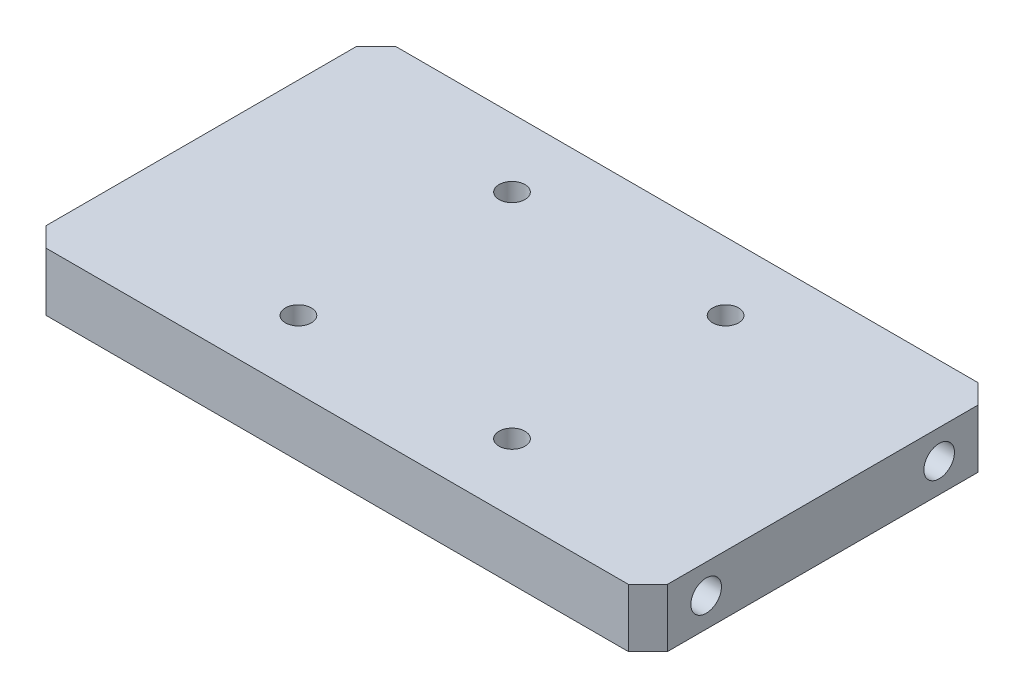
ISO-10303-21;
HEADER;
FILE_DESCRIPTION(('STEP AP214'),'2;1');
FILE_NAME('part.step','',(''),(''),'','','');
FILE_SCHEMA(('AUTOMOTIVE_DESIGN { 1 0 10303 214 1 1 1 1 }'));
ENDSEC;
DATA;
#1=APPLICATION_CONTEXT('core data for automotive mechanical design processes');
#2=APPLICATION_PROTOCOL_DEFINITION('international standard','automotive_design',2000,#1);
#3=PRODUCT_CONTEXT('',#1,'mechanical');
#4=PRODUCT('Part','Part','',(#3));
#5=PRODUCT_RELATED_PRODUCT_CATEGORY('part','',(#4));
#6=PRODUCT_DEFINITION_FORMATION('','',#4);
#7=PRODUCT_DEFINITION_CONTEXT('part definition',#1,'design');
#8=PRODUCT_DEFINITION('design','',#6,#7);
#9=PRODUCT_DEFINITION_SHAPE('','',#8);
#10=(LENGTH_UNIT() NAMED_UNIT(*) SI_UNIT(.MILLI.,.METRE.));
#11=(NAMED_UNIT(*) PLANE_ANGLE_UNIT() SI_UNIT($,.RADIAN.));
#12=(NAMED_UNIT(*) SI_UNIT($,.STERADIAN.) SOLID_ANGLE_UNIT());
#13=UNCERTAINTY_MEASURE_WITH_UNIT(LENGTH_MEASURE(1.E-05),#10,'distance_accuracy_value','');
#14=(GEOMETRIC_REPRESENTATION_CONTEXT(3) GLOBAL_UNCERTAINTY_ASSIGNED_CONTEXT((#13)) GLOBAL_UNIT_ASSIGNED_CONTEXT((#10,
#11,#12)) REPRESENTATION_CONTEXT('',''));
#15=CARTESIAN_POINT('',(0.,0.,0.));
#16=DIRECTION('',(0.,0.,1.));
#17=DIRECTION('',(1.,0.,0.));
#18=AXIS2_PLACEMENT_3D('',#15,#16,#17);
#19=CARTESIAN_POINT('',(101.6,19.05,57.15));
#20=DIRECTION('',(-1.,0.,0.));
#21=DIRECTION('',(0.,0.,1.));
#22=AXIS2_PLACEMENT_3D('',#19,#20,#21);
#23=PLANE('',#22);
#24=CARTESIAN_POINT('',(101.6,9.525,38.1));
#25=DIRECTION('',(-1.,0.,0.));
#26=DIRECTION('',(0.,0.,-1.));
#27=AXIS2_PLACEMENT_3D('',#24,#25,#26);
#28=CIRCLE('',#27,5.);
#29=CARTESIAN_POINT('',(101.6,9.525,33.1));
#30=VERTEX_POINT('',#29);
#31=EDGE_CURVE('E207',#30,#30,#28,.T.);
#32=ORIENTED_EDGE('',*,*,#31,.T.);
#33=EDGE_LOOP('',(#32));
#34=FACE_BOUND('',#33,.T.);
#35=CARTESIAN_POINT('',(101.6,9.525,-38.1));
#36=DIRECTION('',(-1.,0.,0.));
#37=DIRECTION('',(0.,0.,1.));
#38=AXIS2_PLACEMENT_3D('',#35,#36,#37);
#39=CIRCLE('',#38,5.);
#40=CARTESIAN_POINT('',(101.6,9.525,-33.1));
#41=VERTEX_POINT('',#40);
#42=EDGE_CURVE('E201',#41,#41,#39,.T.);
#43=ORIENTED_EDGE('',*,*,#42,.T.);
#44=EDGE_LOOP('',(#43));
#45=FACE_BOUND('',#44,.T.);
#46=DIRECTION('',(0.,0.,-1.));
#47=VECTOR('',#46,1.);
#48=CARTESIAN_POINT('',(101.6,0.,57.15));
#49=LINE('',#48,#47);
#50=CARTESIAN_POINT('',(101.6,0.,50.8));
#51=VERTEX_POINT('',#50);
#52=CARTESIAN_POINT('',(101.6,0.,-50.7999999999999));
#53=VERTEX_POINT('',#52);
#54=EDGE_CURVE('E137',#51,#53,#49,.T.);
#55=ORIENTED_EDGE('',*,*,#54,.T.);
#56=DIRECTION('',(0.,1.,0.));
#57=VECTOR('',#56,1.);
#58=CARTESIAN_POINT('',(101.6,19.05,-50.7999999999999));
#59=LINE('',#58,#57);
#60=CARTESIAN_POINT('',(101.6,19.05,-50.7999999999999));
#61=VERTEX_POINT('',#60);
#62=EDGE_CURVE('E114',#53,#61,#59,.T.);
#63=ORIENTED_EDGE('',*,*,#62,.T.);
#64=DIRECTION('',(0.,0.,-1.));
#65=VECTOR('',#64,1.);
#66=CARTESIAN_POINT('',(101.6,19.05,57.15));
#67=LINE('',#66,#65);
#68=CARTESIAN_POINT('',(101.6,19.05,50.8));
#69=VERTEX_POINT('',#68);
#70=EDGE_CURVE('E147',#69,#61,#67,.T.);
#71=ORIENTED_EDGE('',*,*,#70,.F.);
#72=DIRECTION('',(0.,-1.,0.));
#73=VECTOR('',#72,1.);
#74=CARTESIAN_POINT('',(101.6,19.05,50.8));
#75=LINE('',#74,#73);
#76=EDGE_CURVE('E119',#69,#51,#75,.T.);
#77=ORIENTED_EDGE('',*,*,#76,.T.);
#78=EDGE_LOOP('',(#55,#63,#71,#77));
#79=FACE_BOUND('',#78,.T.);
#80=ADVANCED_FACE('F42',(#34,#45,#79),#23,.F.);
#81=CARTESIAN_POINT('',(-101.6,19.05,-57.15));
#82=DIRECTION('',(0.,0.,1.));
#83=DIRECTION('',(1.,0.,0.));
#84=AXIS2_PLACEMENT_3D('',#81,#82,#83);
#85=PLANE('',#84);
#86=DIRECTION('',(-1.,0.,0.));
#87=VECTOR('',#86,1.);
#88=CARTESIAN_POINT('',(-101.6,19.05,-57.15));
#89=LINE('',#88,#87);
#90=CARTESIAN_POINT('',(95.25,19.05,-57.15));
#91=VERTEX_POINT('',#90);
#92=CARTESIAN_POINT('',(-95.25,19.05,-57.15));
#93=VERTEX_POINT('',#92);
#94=EDGE_CURVE('E129',#91,#93,#89,.T.);
#95=ORIENTED_EDGE('',*,*,#94,.F.);
#96=DIRECTION('',(0.,-1.,0.));
#97=VECTOR('',#96,1.);
#98=CARTESIAN_POINT('',(95.25,19.05,-57.15));
#99=LINE('',#98,#97);
#100=CARTESIAN_POINT('',(95.25,0.,-57.15));
#101=VERTEX_POINT('',#100);
#102=EDGE_CURVE('E113',#91,#101,#99,.T.);
#103=ORIENTED_EDGE('',*,*,#102,.T.);
#104=DIRECTION('',(-1.,0.,0.));
#105=VECTOR('',#104,1.);
#106=CARTESIAN_POINT('',(-101.6,0.,-57.15));
#107=LINE('',#106,#105);
#108=CARTESIAN_POINT('',(-95.25,0.,-57.15));
#109=VERTEX_POINT('',#108);
#110=EDGE_CURVE('E126',#101,#109,#107,.T.);
#111=ORIENTED_EDGE('',*,*,#110,.T.);
#112=DIRECTION('',(0.,1.,0.));
#113=VECTOR('',#112,1.);
#114=CARTESIAN_POINT('',(-95.25,19.05,-57.15));
#115=LINE('',#114,#113);
#116=EDGE_CURVE('E131',#109,#93,#115,.T.);
#117=ORIENTED_EDGE('',*,*,#116,.T.);
#118=EDGE_LOOP('',(#95,#103,#111,#117));
#119=FACE_BOUND('',#118,.T.);
#120=ADVANCED_FACE('F125',(#119),#85,.F.);
#121=CARTESIAN_POINT('',(-101.6,19.05,57.15));
#122=DIRECTION('',(1.,0.,0.));
#123=DIRECTION('',(0.,0.,-1.));
#124=AXIS2_PLACEMENT_3D('',#121,#122,#123);
#125=PLANE('',#124);
#126=CARTESIAN_POINT('',(-101.6,9.525,38.1));
#127=DIRECTION('',(-1.,0.,0.));
#128=DIRECTION('',(0.,0.,-1.));
#129=AXIS2_PLACEMENT_3D('',#126,#127,#128);
#130=CIRCLE('',#129,5.);
#131=CARTESIAN_POINT('',(-101.6,9.525,33.1));
#132=VERTEX_POINT('',#131);
#133=EDGE_CURVE('E195',#132,#132,#130,.T.);
#134=ORIENTED_EDGE('',*,*,#133,.F.);
#135=EDGE_LOOP('',(#134));
#136=FACE_BOUND('',#135,.T.);
#137=CARTESIAN_POINT('',(-101.6,9.525,-38.1));
#138=DIRECTION('',(-1.,0.,0.));
#139=DIRECTION('',(0.,0.,1.));
#140=AXIS2_PLACEMENT_3D('',#137,#138,#139);
#141=CIRCLE('',#140,5.);
#142=CARTESIAN_POINT('',(-101.6,9.525,-33.1));
#143=VERTEX_POINT('',#142);
#144=EDGE_CURVE('E189',#143,#143,#141,.T.);
#145=ORIENTED_EDGE('',*,*,#144,.F.);
#146=EDGE_LOOP('',(#145));
#147=FACE_BOUND('',#146,.T.);
#148=DIRECTION('',(0.,0.,1.));
#149=VECTOR('',#148,1.);
#150=CARTESIAN_POINT('',(-101.6,19.05,57.15));
#151=LINE('',#150,#149);
#152=CARTESIAN_POINT('',(-101.6,19.05,-50.8));
#153=VERTEX_POINT('',#152);
#154=CARTESIAN_POINT('',(-101.6,19.05,50.7999999999999));
#155=VERTEX_POINT('',#154);
#156=EDGE_CURVE('E170',#153,#155,#151,.T.);
#157=ORIENTED_EDGE('',*,*,#156,.F.);
#158=DIRECTION('',(0.,-1.,0.));
#159=VECTOR('',#158,1.);
#160=CARTESIAN_POINT('',(-101.6,19.05,-50.8));
#161=LINE('',#160,#159);
#162=CARTESIAN_POINT('',(-101.6,0.,-50.8));
#163=VERTEX_POINT('',#162);
#164=EDGE_CURVE('E11',#153,#163,#161,.T.);
#165=ORIENTED_EDGE('',*,*,#164,.T.);
#166=DIRECTION('',(0.,0.,1.));
#167=VECTOR('',#166,1.);
#168=CARTESIAN_POINT('',(-101.6,0.,57.15));
#169=LINE('',#168,#167);
#170=CARTESIAN_POINT('',(-101.6,0.,50.7999999999999));
#171=VERTEX_POINT('',#170);
#172=EDGE_CURVE('E136',#163,#171,#169,.T.);
#173=ORIENTED_EDGE('',*,*,#172,.T.);
#174=DIRECTION('',(0.,1.,0.));
#175=VECTOR('',#174,1.);
#176=CARTESIAN_POINT('',(-101.6,19.05,50.7999999999999));
#177=LINE('',#176,#175);
#178=EDGE_CURVE('E50',#171,#155,#177,.T.);
#179=ORIENTED_EDGE('',*,*,#178,.T.);
#180=EDGE_LOOP('',(#157,#165,#173,#179));
#181=FACE_BOUND('',#180,.T.);
#182=ADVANCED_FACE('F169',(#136,#147,#181),#125,.F.);
#183=CARTESIAN_POINT('',(-101.6,19.05,57.15));
#184=DIRECTION('',(0.,0.,-1.));
#185=DIRECTION('',(-1.,0.,0.));
#186=AXIS2_PLACEMENT_3D('',#183,#184,#185);
#187=PLANE('',#186);
#188=DIRECTION('',(1.,0.,0.));
#189=VECTOR('',#188,1.);
#190=CARTESIAN_POINT('',(-101.6,0.,57.15));
#191=LINE('',#190,#189);
#192=CARTESIAN_POINT('',(-95.25,0.,57.15));
#193=VERTEX_POINT('',#192);
#194=CARTESIAN_POINT('',(95.25,0.,57.15));
#195=VERTEX_POINT('',#194);
#196=EDGE_CURVE('E140',#193,#195,#191,.T.);
#197=ORIENTED_EDGE('',*,*,#196,.T.);
#198=DIRECTION('',(0.,1.,0.));
#199=VECTOR('',#198,1.);
#200=CARTESIAN_POINT('',(95.25,19.05,57.15));
#201=LINE('',#200,#199);
#202=CARTESIAN_POINT('',(95.25,19.05,57.15));
#203=VERTEX_POINT('',#202);
#204=EDGE_CURVE('E57',#195,#203,#201,.T.);
#205=ORIENTED_EDGE('',*,*,#204,.T.);
#206=DIRECTION('',(1.,0.,0.));
#207=VECTOR('',#206,1.);
#208=CARTESIAN_POINT('',(-101.6,19.05,57.15));
#209=LINE('',#208,#207);
#210=CARTESIAN_POINT('',(-95.25,19.05,57.15));
#211=VERTEX_POINT('',#210);
#212=EDGE_CURVE('E148',#211,#203,#209,.T.);
#213=ORIENTED_EDGE('',*,*,#212,.F.);
#214=DIRECTION('',(0.,-1.,0.));
#215=VECTOR('',#214,1.);
#216=CARTESIAN_POINT('',(-95.25,19.05,57.15));
#217=LINE('',#216,#215);
#218=EDGE_CURVE('E163',#211,#193,#217,.T.);
#219=ORIENTED_EDGE('',*,*,#218,.T.);
#220=EDGE_LOOP('',(#197,#205,#213,#219));
#221=FACE_BOUND('',#220,.T.);
#222=ADVANCED_FACE('F179',(#221),#187,.F.);
#223=CARTESIAN_POINT('',(0.,19.05,0.));
#224=DIRECTION('',(0.,-1.,0.));
#225=DIRECTION('',(0.,0.,-1.));
#226=AXIS2_PLACEMENT_3D('',#223,#224,#225);
#227=PLANE('',#226);
#228=CARTESIAN_POINT('',(34.925,19.05,34.925));
#229=DIRECTION('',(0.,1.,0.));
#230=DIRECTION('',(0.,0.,1.));
#231=AXIS2_PLACEMENT_3D('',#228,#229,#230);
#232=CIRCLE('',#231,4.25);
#233=CARTESIAN_POINT('',(34.925,19.05,39.175));
#234=VERTEX_POINT('',#233);
#235=EDGE_CURVE('E233',#234,#234,#232,.T.);
#236=ORIENTED_EDGE('',*,*,#235,.F.);
#237=EDGE_LOOP('',(#236));
#238=FACE_BOUND('',#237,.T.);
#239=CARTESIAN_POINT('',(-34.925,19.05,34.925));
#240=DIRECTION('',(0.,1.,0.));
#241=DIRECTION('',(0.,0.,1.));
#242=AXIS2_PLACEMENT_3D('',#239,#240,#241);
#243=CIRCLE('',#242,4.25);
#244=CARTESIAN_POINT('',(-34.925,19.05,39.175));
#245=VERTEX_POINT('',#244);
#246=EDGE_CURVE('E227',#245,#245,#243,.T.);
#247=ORIENTED_EDGE('',*,*,#246,.F.);
#248=EDGE_LOOP('',(#247));
#249=FACE_BOUND('',#248,.T.);
#250=CARTESIAN_POINT('',(34.925,19.05,-34.925));
#251=DIRECTION('',(0.,1.,0.));
#252=DIRECTION('',(0.,0.,1.));
#253=AXIS2_PLACEMENT_3D('',#250,#251,#252);
#254=CIRCLE('',#253,4.25);
#255=CARTESIAN_POINT('',(34.925,19.05,-30.675));
#256=VERTEX_POINT('',#255);
#257=EDGE_CURVE('E221',#256,#256,#254,.T.);
#258=ORIENTED_EDGE('',*,*,#257,.F.);
#259=EDGE_LOOP('',(#258));
#260=FACE_BOUND('',#259,.T.);
#261=CARTESIAN_POINT('',(-34.925,19.05,-34.925));
#262=DIRECTION('',(0.,1.,0.));
#263=DIRECTION('',(0.,0.,1.));
#264=AXIS2_PLACEMENT_3D('',#261,#262,#263);
#265=CIRCLE('',#264,4.25);
#266=CARTESIAN_POINT('',(-34.925,19.05,-30.675));
#267=VERTEX_POINT('',#266);
#268=EDGE_CURVE('E215',#267,#267,#265,.T.);
#269=ORIENTED_EDGE('',*,*,#268,.F.);
#270=EDGE_LOOP('',(#269));
#271=FACE_BOUND('',#270,.T.);
#272=ORIENTED_EDGE('',*,*,#70,.T.);
#273=DIRECTION('',(0.707106781186546,0.,0.707106781186549));
#274=VECTOR('',#273,1.);
#275=CARTESIAN_POINT('',(95.25,19.05,-57.15));
#276=LINE('',#275,#274);
#277=EDGE_CURVE('E161',#61,#91,#276,.F.);
#278=ORIENTED_EDGE('',*,*,#277,.T.);
#279=ORIENTED_EDGE('',*,*,#94,.T.);
#280=DIRECTION('',(0.707106781186549,0.,-0.707106781186546));
#281=VECTOR('',#280,1.);
#282=CARTESIAN_POINT('',(-101.6,19.05,-50.8));
#283=LINE('',#282,#281);
#284=EDGE_CURVE('E157',#93,#153,#283,.F.);
#285=ORIENTED_EDGE('',*,*,#284,.T.);
#286=ORIENTED_EDGE('',*,*,#156,.T.);
#287=DIRECTION('',(-0.707106781186546,0.,-0.707106781186549));
#288=VECTOR('',#287,1.);
#289=CARTESIAN_POINT('',(-95.25,19.05,57.15));
#290=LINE('',#289,#288);
#291=EDGE_CURVE('E64',#155,#211,#290,.F.);
#292=ORIENTED_EDGE('',*,*,#291,.T.);
#293=ORIENTED_EDGE('',*,*,#212,.T.);
#294=DIRECTION('',(-0.707106781186549,0.,0.707106781186546));
#295=VECTOR('',#294,1.);
#296=CARTESIAN_POINT('',(101.6,19.05,50.8));
#297=LINE('',#296,#295);
#298=EDGE_CURVE('E159',#203,#69,#297,.F.);
#299=ORIENTED_EDGE('',*,*,#298,.T.);
#300=EDGE_LOOP('',(#272,#278,#279,#285,#286,#292,#293,#299));
#301=FACE_BOUND('',#300,.T.);
#302=ADVANCED_FACE('F174',(#238,#249,#260,#271,#301),#227,.F.);
#303=CARTESIAN_POINT('',(0.,0.,0.));
#304=DIRECTION('',(0.,-1.,0.));
#305=DIRECTION('',(0.,0.,-1.));
#306=AXIS2_PLACEMENT_3D('',#303,#304,#305);
#307=PLANE('',#306);
#308=CARTESIAN_POINT('',(34.925,0.,34.925));
#309=DIRECTION('',(0.,1.,0.));
#310=DIRECTION('',(0.,0.,1.));
#311=AXIS2_PLACEMENT_3D('',#308,#309,#310);
#312=CIRCLE('',#311,4.25);
#313=CARTESIAN_POINT('',(34.925,0.,39.175));
#314=VERTEX_POINT('',#313);
#315=EDGE_CURVE('E230',#314,#314,#312,.T.);
#316=ORIENTED_EDGE('',*,*,#315,.T.);
#317=EDGE_LOOP('',(#316));
#318=FACE_BOUND('',#317,.T.);
#319=CARTESIAN_POINT('',(-34.925,0.,34.925));
#320=DIRECTION('',(0.,1.,0.));
#321=DIRECTION('',(0.,0.,1.));
#322=AXIS2_PLACEMENT_3D('',#319,#320,#321);
#323=CIRCLE('',#322,4.25);
#324=CARTESIAN_POINT('',(-34.925,0.,39.175));
#325=VERTEX_POINT('',#324);
#326=EDGE_CURVE('E224',#325,#325,#323,.T.);
#327=ORIENTED_EDGE('',*,*,#326,.T.);
#328=EDGE_LOOP('',(#327));
#329=FACE_BOUND('',#328,.T.);
#330=CARTESIAN_POINT('',(34.925,0.,-34.925));
#331=DIRECTION('',(0.,1.,0.));
#332=DIRECTION('',(0.,0.,1.));
#333=AXIS2_PLACEMENT_3D('',#330,#331,#332);
#334=CIRCLE('',#333,4.25);
#335=CARTESIAN_POINT('',(34.925,0.,-30.675));
#336=VERTEX_POINT('',#335);
#337=EDGE_CURVE('E218',#336,#336,#334,.T.);
#338=ORIENTED_EDGE('',*,*,#337,.T.);
#339=EDGE_LOOP('',(#338));
#340=FACE_BOUND('',#339,.T.);
#341=CARTESIAN_POINT('',(-34.925,0.,-34.925));
#342=DIRECTION('',(0.,1.,0.));
#343=DIRECTION('',(0.,0.,1.));
#344=AXIS2_PLACEMENT_3D('',#341,#342,#343);
#345=CIRCLE('',#344,4.25);
#346=CARTESIAN_POINT('',(-34.925,0.,-30.675));
#347=VERTEX_POINT('',#346);
#348=EDGE_CURVE('E210',#347,#347,#345,.T.);
#349=ORIENTED_EDGE('',*,*,#348,.T.);
#350=EDGE_LOOP('',(#349));
#351=FACE_BOUND('',#350,.T.);
#352=ORIENTED_EDGE('',*,*,#110,.F.);
#353=DIRECTION('',(-0.707106781186546,0.,-0.707106781186549));
#354=VECTOR('',#353,1.);
#355=CARTESIAN_POINT('',(76.2000000000002,0.,-76.1999999999999));
#356=LINE('',#355,#354);
#357=EDGE_CURVE('E109',#101,#53,#356,.F.);
#358=ORIENTED_EDGE('',*,*,#357,.T.);
#359=ORIENTED_EDGE('',*,*,#54,.F.);
#360=DIRECTION('',(0.707106781186549,0.,-0.707106781186546));
#361=VECTOR('',#360,1.);
#362=CARTESIAN_POINT('',(76.1999999999998,0.,76.2000000000001));
#363=LINE('',#362,#361);
#364=EDGE_CURVE('E120',#51,#195,#363,.F.);
#365=ORIENTED_EDGE('',*,*,#364,.T.);
#366=ORIENTED_EDGE('',*,*,#196,.F.);
#367=DIRECTION('',(0.707106781186546,0.,0.707106781186549));
#368=VECTOR('',#367,1.);
#369=CARTESIAN_POINT('',(-76.2000000000002,0.,76.1999999999999));
#370=LINE('',#369,#368);
#371=EDGE_CURVE('E130',#193,#171,#370,.F.);
#372=ORIENTED_EDGE('',*,*,#371,.T.);
#373=ORIENTED_EDGE('',*,*,#172,.F.);
#374=DIRECTION('',(-0.707106781186549,0.,0.707106781186546));
#375=VECTOR('',#374,1.);
#376=CARTESIAN_POINT('',(-76.1999999999998,0.,-76.2000000000001));
#377=LINE('',#376,#375);
#378=EDGE_CURVE('E135',#163,#109,#377,.F.);
#379=ORIENTED_EDGE('',*,*,#378,.T.);
#380=EDGE_LOOP('',(#352,#358,#359,#365,#366,#372,#373,#379));
#381=FACE_BOUND('',#380,.T.);
#382=ADVANCED_FACE('F133',(#318,#329,#340,#351,#381),#307,.T.);
#383=CARTESIAN_POINT('',(-82.55,9.525,-38.1));
#384=DIRECTION('',(-1.,0.,0.));
#385=DIRECTION('',(0.,0.,1.));
#386=AXIS2_PLACEMENT_3D('',#383,#384,#385);
#387=CYLINDRICAL_SURFACE('',#386,5.);
#388=CARTESIAN_POINT('',(-82.55,9.525,-38.1));
#389=DIRECTION('',(-1.,0.,0.));
#390=DIRECTION('',(0.,0.,1.));
#391=AXIS2_PLACEMENT_3D('',#388,#389,#390);
#392=CIRCLE('',#391,5.);
#393=CARTESIAN_POINT('',(-82.55,9.525,-33.1));
#394=VERTEX_POINT('',#393);
#395=EDGE_CURVE('E142',#394,#394,#392,.T.);
#396=ORIENTED_EDGE('',*,*,#395,.F.);
#397=EDGE_LOOP('',(#396));
#398=FACE_BOUND('',#397,.T.);
#399=ORIENTED_EDGE('',*,*,#144,.T.);
#400=EDGE_LOOP('',(#399));
#401=FACE_BOUND('',#400,.T.);
#402=ADVANCED_FACE('F345',(#398,#401),#387,.F.);
#403=CARTESIAN_POINT('',(-82.55,9.525,-38.1));
#404=DIRECTION('',(-1.,0.,0.));
#405=DIRECTION('',(0.,0.,1.));
#406=AXIS2_PLACEMENT_3D('',#403,#404,#405);
#407=PLANE('',#406);
#408=ORIENTED_EDGE('',*,*,#395,.T.);
#409=EDGE_LOOP('',(#408));
#410=FACE_BOUND('',#409,.T.);
#411=ADVANCED_FACE('F459',(#410),#407,.T.);
#412=CARTESIAN_POINT('',(-82.55,9.525,38.1));
#413=DIRECTION('',(-1.,0.,0.));
#414=DIRECTION('',(0.,0.,1.));
#415=AXIS2_PLACEMENT_3D('',#412,#413,#414);
#416=CYLINDRICAL_SURFACE('',#415,5.);
#417=CARTESIAN_POINT('',(-82.55,9.525,38.1));
#418=DIRECTION('',(-1.,0.,0.));
#419=DIRECTION('',(0.,0.,-1.));
#420=AXIS2_PLACEMENT_3D('',#417,#418,#419);
#421=CIRCLE('',#420,5.);
#422=CARTESIAN_POINT('',(-82.55,9.525,33.1));
#423=VERTEX_POINT('',#422);
#424=EDGE_CURVE('E192',#423,#423,#421,.T.);
#425=ORIENTED_EDGE('',*,*,#424,.F.);
#426=EDGE_LOOP('',(#425));
#427=FACE_BOUND('',#426,.T.);
#428=ORIENTED_EDGE('',*,*,#133,.T.);
#429=EDGE_LOOP('',(#428));
#430=FACE_BOUND('',#429,.T.);
#431=ADVANCED_FACE('F447',(#427,#430),#416,.F.);
#432=CARTESIAN_POINT('',(-82.55,9.525,38.1));
#433=DIRECTION('',(1.,0.,0.));
#434=DIRECTION('',(0.,0.,-1.));
#435=AXIS2_PLACEMENT_3D('',#432,#433,#434);
#436=PLANE('',#435);
#437=ORIENTED_EDGE('',*,*,#424,.T.);
#438=EDGE_LOOP('',(#437));
#439=FACE_BOUND('',#438,.T.);
#440=ADVANCED_FACE('F435',(#439),#436,.F.);
#441=CARTESIAN_POINT('',(82.55,9.525,-38.1));
#442=DIRECTION('',(1.,0.,0.));
#443=DIRECTION('',(0.,0.,-1.));
#444=AXIS2_PLACEMENT_3D('',#441,#442,#443);
#445=CYLINDRICAL_SURFACE('',#444,5.);
#446=CARTESIAN_POINT('',(82.55,9.525,-38.1));
#447=DIRECTION('',(-1.,0.,0.));
#448=DIRECTION('',(0.,0.,1.));
#449=AXIS2_PLACEMENT_3D('',#446,#447,#448);
#450=CIRCLE('',#449,5.);
#451=CARTESIAN_POINT('',(82.55,9.525,-33.1));
#452=VERTEX_POINT('',#451);
#453=EDGE_CURVE('E198',#452,#452,#450,.T.);
#454=ORIENTED_EDGE('',*,*,#453,.T.);
#455=EDGE_LOOP('',(#454));
#456=FACE_BOUND('',#455,.T.);
#457=ORIENTED_EDGE('',*,*,#42,.F.);
#458=EDGE_LOOP('',(#457));
#459=FACE_BOUND('',#458,.T.);
#460=ADVANCED_FACE('F423',(#456,#459),#445,.F.);
#461=CARTESIAN_POINT('',(82.55,9.525,-38.1));
#462=DIRECTION('',(1.,0.,0.));
#463=DIRECTION('',(0.,0.,1.));
#464=AXIS2_PLACEMENT_3D('',#461,#462,#463);
#465=PLANE('',#464);
#466=ORIENTED_EDGE('',*,*,#453,.F.);
#467=EDGE_LOOP('',(#466));
#468=FACE_BOUND('',#467,.T.);
#469=ADVANCED_FACE('F411',(#468),#465,.T.);
#470=CARTESIAN_POINT('',(82.55,9.525,38.1));
#471=DIRECTION('',(1.,0.,0.));
#472=DIRECTION('',(0.,0.,-1.));
#473=AXIS2_PLACEMENT_3D('',#470,#471,#472);
#474=CYLINDRICAL_SURFACE('',#473,5.);
#475=CARTESIAN_POINT('',(82.55,9.525,38.1));
#476=DIRECTION('',(-1.,0.,0.));
#477=DIRECTION('',(0.,0.,-1.));
#478=AXIS2_PLACEMENT_3D('',#475,#476,#477);
#479=CIRCLE('',#478,5.);
#480=CARTESIAN_POINT('',(82.55,9.525,33.1));
#481=VERTEX_POINT('',#480);
#482=EDGE_CURVE('E204',#481,#481,#479,.T.);
#483=ORIENTED_EDGE('',*,*,#482,.T.);
#484=EDGE_LOOP('',(#483));
#485=FACE_BOUND('',#484,.T.);
#486=ORIENTED_EDGE('',*,*,#31,.F.);
#487=EDGE_LOOP('',(#486));
#488=FACE_BOUND('',#487,.T.);
#489=ADVANCED_FACE('F398',(#485,#488),#474,.F.);
#490=CARTESIAN_POINT('',(82.55,9.525,38.1));
#491=DIRECTION('',(-1.,0.,0.));
#492=DIRECTION('',(0.,0.,-1.));
#493=AXIS2_PLACEMENT_3D('',#490,#491,#492);
#494=PLANE('',#493);
#495=ORIENTED_EDGE('',*,*,#482,.F.);
#496=EDGE_LOOP('',(#495));
#497=FACE_BOUND('',#496,.T.);
#498=ADVANCED_FACE('F275',(#497),#494,.F.);
#499=CARTESIAN_POINT('',(95.25,19.05,-57.15));
#500=DIRECTION('',(-0.707106781186549,0.,0.707106781186546));
#501=DIRECTION('',(0.,-1.,0.));
#502=AXIS2_PLACEMENT_3D('',#499,#500,#501);
#503=PLANE('',#502);
#504=ORIENTED_EDGE('',*,*,#277,.F.);
#505=ORIENTED_EDGE('',*,*,#62,.F.);
#506=ORIENTED_EDGE('',*,*,#357,.F.);
#507=ORIENTED_EDGE('',*,*,#102,.F.);
#508=EDGE_LOOP('',(#504,#505,#506,#507));
#509=FACE_BOUND('',#508,.T.);
#510=ADVANCED_FACE('F112',(#509),#503,.F.);
#511=CARTESIAN_POINT('',(101.6,19.05,50.8));
#512=DIRECTION('',(-0.707106781186546,0.,-0.707106781186549));
#513=DIRECTION('',(0.,-1.,0.));
#514=AXIS2_PLACEMENT_3D('',#511,#512,#513);
#515=PLANE('',#514);
#516=ORIENTED_EDGE('',*,*,#298,.F.);
#517=ORIENTED_EDGE('',*,*,#204,.F.);
#518=ORIENTED_EDGE('',*,*,#364,.F.);
#519=ORIENTED_EDGE('',*,*,#76,.F.);
#520=EDGE_LOOP('',(#516,#517,#518,#519));
#521=FACE_BOUND('',#520,.T.);
#522=ADVANCED_FACE('F183',(#521),#515,.F.);
#523=CARTESIAN_POINT('',(-101.6,19.05,-50.8));
#524=DIRECTION('',(0.707106781186546,0.,0.707106781186549));
#525=DIRECTION('',(0.,-1.,0.));
#526=AXIS2_PLACEMENT_3D('',#523,#524,#525);
#527=PLANE('',#526);
#528=ORIENTED_EDGE('',*,*,#284,.F.);
#529=ORIENTED_EDGE('',*,*,#116,.F.);
#530=ORIENTED_EDGE('',*,*,#378,.F.);
#531=ORIENTED_EDGE('',*,*,#164,.F.);
#532=EDGE_LOOP('',(#528,#529,#530,#531));
#533=FACE_BOUND('',#532,.T.);
#534=ADVANCED_FACE('F260',(#533),#527,.F.);
#535=CARTESIAN_POINT('',(-95.25,19.05,57.15));
#536=DIRECTION('',(0.707106781186549,0.,-0.707106781186546));
#537=DIRECTION('',(0.,-1.,0.));
#538=AXIS2_PLACEMENT_3D('',#535,#536,#537);
#539=PLANE('',#538);
#540=ORIENTED_EDGE('',*,*,#291,.F.);
#541=ORIENTED_EDGE('',*,*,#178,.F.);
#542=ORIENTED_EDGE('',*,*,#371,.F.);
#543=ORIENTED_EDGE('',*,*,#218,.F.);
#544=EDGE_LOOP('',(#540,#541,#542,#543));
#545=FACE_BOUND('',#544,.T.);
#546=ADVANCED_FACE('F44',(#545),#539,.F.);
#547=CARTESIAN_POINT('',(-34.925,19.05,-34.925));
#548=DIRECTION('',(0.,1.,0.));
#549=DIRECTION('',(0.,0.,1.));
#550=AXIS2_PLACEMENT_3D('',#547,#548,#549);
#551=CYLINDRICAL_SURFACE('',#550,4.25);
#552=ORIENTED_EDGE('',*,*,#348,.F.);
#553=EDGE_LOOP('',(#552));
#554=FACE_BOUND('',#553,.T.);
#555=ORIENTED_EDGE('',*,*,#268,.T.);
#556=EDGE_LOOP('',(#555));
#557=FACE_BOUND('',#556,.T.);
#558=ADVANCED_FACE('F248',(#554,#557),#551,.F.);
#559=CARTESIAN_POINT('',(34.925,19.05,-34.925));
#560=DIRECTION('',(0.,1.,0.));
#561=DIRECTION('',(0.,0.,1.));
#562=AXIS2_PLACEMENT_3D('',#559,#560,#561);
#563=CYLINDRICAL_SURFACE('',#562,4.25);
#564=ORIENTED_EDGE('',*,*,#337,.F.);
#565=EDGE_LOOP('',(#564));
#566=FACE_BOUND('',#565,.T.);
#567=ORIENTED_EDGE('',*,*,#257,.T.);
#568=EDGE_LOOP('',(#567));
#569=FACE_BOUND('',#568,.T.);
#570=ADVANCED_FACE('F250',(#566,#569),#563,.F.);
#571=CARTESIAN_POINT('',(-34.925,19.05,34.925));
#572=DIRECTION('',(0.,1.,0.));
#573=DIRECTION('',(0.,0.,1.));
#574=AXIS2_PLACEMENT_3D('',#571,#572,#573);
#575=CYLINDRICAL_SURFACE('',#574,4.25);
#576=ORIENTED_EDGE('',*,*,#326,.F.);
#577=EDGE_LOOP('',(#576));
#578=FACE_BOUND('',#577,.T.);
#579=ORIENTED_EDGE('',*,*,#246,.T.);
#580=EDGE_LOOP('',(#579));
#581=FACE_BOUND('',#580,.T.);
#582=ADVANCED_FACE('F257',(#578,#581),#575,.F.);
#583=CARTESIAN_POINT('',(34.925,19.05,34.925));
#584=DIRECTION('',(0.,1.,0.));
#585=DIRECTION('',(0.,0.,1.));
#586=AXIS2_PLACEMENT_3D('',#583,#584,#585);
#587=CYLINDRICAL_SURFACE('',#586,4.25);
#588=ORIENTED_EDGE('',*,*,#315,.F.);
#589=EDGE_LOOP('',(#588));
#590=FACE_BOUND('',#589,.T.);
#591=ORIENTED_EDGE('',*,*,#235,.T.);
#592=EDGE_LOOP('',(#591));
#593=FACE_BOUND('',#592,.T.);
#594=ADVANCED_FACE('F237',(#590,#593),#587,.F.);
#595=CLOSED_SHELL('',(#80,#120,#182,#222,#302,#382,#402,#411,#431,#440,#460,#469,#489,#498,#510,
#522,#534,#546,#558,#570,#582,#594));
#596=MANIFOLD_SOLID_BREP('B2',#595);
#597=ADVANCED_BREP_SHAPE_REPRESENTATION('',(#18,#596),#14);
#598=SHAPE_DEFINITION_REPRESENTATION(#9,#597);
ENDSEC;
END-ISO-10303-21;
